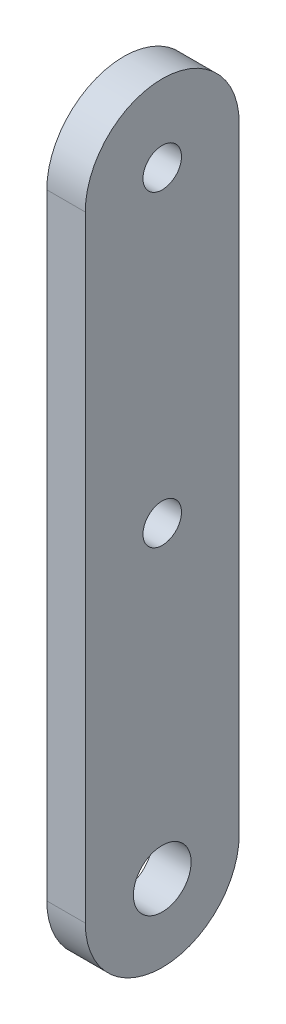
ISO-10303-21;
HEADER;
FILE_DESCRIPTION(('STEP AP214'),'2;1');
FILE_NAME('part.step','',(''),(''),'','','');
FILE_SCHEMA(('AUTOMOTIVE_DESIGN { 1 0 10303 214 1 1 1 1 }'));
ENDSEC;
DATA;
#1=APPLICATION_CONTEXT('core data for automotive mechanical design processes');
#2=APPLICATION_PROTOCOL_DEFINITION('international standard','automotive_design',2000,#1);
#3=PRODUCT_CONTEXT('',#1,'mechanical');
#4=PRODUCT('Part','Part','',(#3));
#5=PRODUCT_RELATED_PRODUCT_CATEGORY('part','',(#4));
#6=PRODUCT_DEFINITION_FORMATION('','',#4);
#7=PRODUCT_DEFINITION_CONTEXT('part definition',#1,'design');
#8=PRODUCT_DEFINITION('design','',#6,#7);
#9=PRODUCT_DEFINITION_SHAPE('','',#8);
#10=(LENGTH_UNIT() NAMED_UNIT(*) SI_UNIT(.MILLI.,.METRE.));
#11=(NAMED_UNIT(*) PLANE_ANGLE_UNIT() SI_UNIT($,.RADIAN.));
#12=(NAMED_UNIT(*) SI_UNIT($,.STERADIAN.) SOLID_ANGLE_UNIT());
#13=UNCERTAINTY_MEASURE_WITH_UNIT(LENGTH_MEASURE(1.E-05),#10,'distance_accuracy_value','');
#14=(GEOMETRIC_REPRESENTATION_CONTEXT(3) GLOBAL_UNCERTAINTY_ASSIGNED_CONTEXT((#13)) GLOBAL_UNIT_ASSIGNED_CONTEXT((#10,
#11,#12)) REPRESENTATION_CONTEXT('',''));
#15=CARTESIAN_POINT('',(0.,0.,0.));
#16=DIRECTION('',(0.,0.,1.));
#17=DIRECTION('',(1.,0.,0.));
#18=AXIS2_PLACEMENT_3D('',#15,#16,#17);
#19=CARTESIAN_POINT('',(6.35,50.8,0.));
#20=DIRECTION('',(1.,0.,0.));
#21=DIRECTION('',(0.,0.,-1.));
#22=AXIS2_PLACEMENT_3D('',#19,#20,#21);
#23=PLANE('',#22);
#24=CARTESIAN_POINT('',(6.35,0.,0.));
#25=DIRECTION('',(1.,0.,0.));
#26=DIRECTION('',(0.,0.,-1.));
#27=AXIS2_PLACEMENT_3D('',#24,#25,#26);
#28=CIRCLE('',#27,3.175);
#29=CARTESIAN_POINT('',(6.35,0.,-3.175));
#30=VERTEX_POINT('',#29);
#31=EDGE_CURVE('E134',#30,#30,#28,.T.);
#32=ORIENTED_EDGE('',*,*,#31,.F.);
#33=EDGE_LOOP('',(#32));
#34=FACE_BOUND('',#33,.T.);
#35=CARTESIAN_POINT('',(6.35,50.8,0.));
#36=DIRECTION('',(1.,0.,0.));
#37=DIRECTION('',(0.,0.,-1.));
#38=AXIS2_PLACEMENT_3D('',#35,#36,#37);
#39=CIRCLE('',#38,12.7);
#40=CARTESIAN_POINT('',(6.35,50.8,-12.7));
#41=VERTEX_POINT('',#40);
#42=CARTESIAN_POINT('',(6.35,50.8,12.7));
#43=VERTEX_POINT('',#42);
#44=EDGE_CURVE('E92',#41,#43,#39,.T.);
#45=ORIENTED_EDGE('',*,*,#44,.T.);
#46=DIRECTION('',(0.,-1.,0.));
#47=VECTOR('',#46,1.);
#48=CARTESIAN_POINT('',(6.35,50.8,12.7));
#49=LINE('',#48,#47);
#50=CARTESIAN_POINT('',(6.35,-50.8,12.7));
#51=VERTEX_POINT('',#50);
#52=EDGE_CURVE('E87',#43,#51,#49,.T.);
#53=ORIENTED_EDGE('',*,*,#52,.T.);
#54=CARTESIAN_POINT('',(6.35,-50.8,0.));
#55=DIRECTION('',(1.,0.,0.));
#56=DIRECTION('',(0.,0.,-1.));
#57=AXIS2_PLACEMENT_3D('',#54,#55,#56);
#58=CIRCLE('',#57,12.7);
#59=CARTESIAN_POINT('',(6.35,-50.8,-12.7));
#60=VERTEX_POINT('',#59);
#61=EDGE_CURVE('E90',#51,#60,#58,.T.);
#62=ORIENTED_EDGE('',*,*,#61,.T.);
#63=DIRECTION('',(0.,1.,0.));
#64=VECTOR('',#63,1.);
#65=CARTESIAN_POINT('',(6.35,50.8,-12.7));
#66=LINE('',#65,#64);
#67=EDGE_CURVE('E57',#60,#41,#66,.T.);
#68=ORIENTED_EDGE('',*,*,#67,.T.);
#69=EDGE_LOOP('',(#45,#53,#62,#68));
#70=FACE_BOUND('',#69,.T.);
#71=CARTESIAN_POINT('',(6.35,50.8,0.));
#72=DIRECTION('',(1.,0.,0.));
#73=DIRECTION('',(0.,0.,-1.));
#74=AXIS2_PLACEMENT_3D('',#71,#72,#73);
#75=CIRCLE('',#74,3.175);
#76=CARTESIAN_POINT('',(6.35,50.8,-3.175));
#77=VERTEX_POINT('',#76);
#78=EDGE_CURVE('E112',#77,#77,#75,.T.);
#79=ORIENTED_EDGE('',*,*,#78,.F.);
#80=EDGE_LOOP('',(#79));
#81=FACE_BOUND('',#80,.T.);
#82=CARTESIAN_POINT('',(6.35,-50.8,0.));
#83=DIRECTION('',(1.,0.,0.));
#84=DIRECTION('',(0.,0.,-1.));
#85=AXIS2_PLACEMENT_3D('',#82,#83,#84);
#86=CIRCLE('',#85,4.7625);
#87=CARTESIAN_POINT('',(6.35,-50.8,-4.76250000000001));
#88=VERTEX_POINT('',#87);
#89=EDGE_CURVE('E142',#88,#88,#86,.T.);
#90=ORIENTED_EDGE('',*,*,#89,.F.);
#91=EDGE_LOOP('',(#90));
#92=FACE_BOUND('',#91,.T.);
#93=ADVANCED_FACE('F39',(#34,#70,#81,#92),#23,.T.);
#94=CARTESIAN_POINT('',(0.,50.8,0.));
#95=DIRECTION('',(1.,0.,0.));
#96=DIRECTION('',(0.,0.,-1.));
#97=AXIS2_PLACEMENT_3D('',#94,#95,#96);
#98=PLANE('',#97);
#99=CARTESIAN_POINT('',(0.,50.8,0.));
#100=DIRECTION('',(1.,0.,0.));
#101=DIRECTION('',(0.,0.,-1.));
#102=AXIS2_PLACEMENT_3D('',#99,#100,#101);
#103=CIRCLE('',#102,12.7);
#104=CARTESIAN_POINT('',(0.,50.8,-12.7));
#105=VERTEX_POINT('',#104);
#106=CARTESIAN_POINT('',(0.,50.8,12.7));
#107=VERTEX_POINT('',#106);
#108=EDGE_CURVE('E108',#105,#107,#103,.T.);
#109=ORIENTED_EDGE('',*,*,#108,.F.);
#110=DIRECTION('',(0.,1.,0.));
#111=VECTOR('',#110,1.);
#112=CARTESIAN_POINT('',(0.,50.8,-12.7));
#113=LINE('',#112,#111);
#114=CARTESIAN_POINT('',(0.,-50.8,-12.7));
#115=VERTEX_POINT('',#114);
#116=EDGE_CURVE('E80',#115,#105,#113,.T.);
#117=ORIENTED_EDGE('',*,*,#116,.F.);
#118=CARTESIAN_POINT('',(0.,-50.8,0.));
#119=DIRECTION('',(1.,0.,0.));
#120=DIRECTION('',(0.,0.,-1.));
#121=AXIS2_PLACEMENT_3D('',#118,#119,#120);
#122=CIRCLE('',#121,12.7);
#123=CARTESIAN_POINT('',(0.,-50.8,12.7));
#124=VERTEX_POINT('',#123);
#125=EDGE_CURVE('E74',#124,#115,#122,.T.);
#126=ORIENTED_EDGE('',*,*,#125,.F.);
#127=DIRECTION('',(0.,-1.,0.));
#128=VECTOR('',#127,1.);
#129=CARTESIAN_POINT('',(0.,50.8,12.7));
#130=LINE('',#129,#128);
#131=EDGE_CURVE('E97',#107,#124,#130,.T.);
#132=ORIENTED_EDGE('',*,*,#131,.F.);
#133=EDGE_LOOP('',(#109,#117,#126,#132));
#134=FACE_BOUND('',#133,.T.);
#135=CARTESIAN_POINT('',(0.,50.8,0.));
#136=DIRECTION('',(1.,0.,0.));
#137=DIRECTION('',(0.,0.,-1.));
#138=AXIS2_PLACEMENT_3D('',#135,#136,#137);
#139=CIRCLE('',#138,3.175);
#140=CARTESIAN_POINT('',(0.,50.8,-3.175));
#141=VERTEX_POINT('',#140);
#142=EDGE_CURVE('E130',#141,#141,#139,.T.);
#143=ORIENTED_EDGE('',*,*,#142,.T.);
#144=EDGE_LOOP('',(#143));
#145=FACE_BOUND('',#144,.T.);
#146=CARTESIAN_POINT('',(0.,0.,0.));
#147=DIRECTION('',(1.,0.,0.));
#148=DIRECTION('',(0.,0.,-1.));
#149=AXIS2_PLACEMENT_3D('',#146,#147,#148);
#150=CIRCLE('',#149,3.175);
#151=CARTESIAN_POINT('',(0.,0.,-3.175));
#152=VERTEX_POINT('',#151);
#153=EDGE_CURVE('E138',#152,#152,#150,.T.);
#154=ORIENTED_EDGE('',*,*,#153,.T.);
#155=EDGE_LOOP('',(#154));
#156=FACE_BOUND('',#155,.T.);
#157=CARTESIAN_POINT('',(0.,-50.8,0.));
#158=DIRECTION('',(1.,0.,0.));
#159=DIRECTION('',(0.,0.,-1.));
#160=AXIS2_PLACEMENT_3D('',#157,#158,#159);
#161=CIRCLE('',#160,4.7625);
#162=CARTESIAN_POINT('',(0.,-50.8,-4.76250000000001));
#163=VERTEX_POINT('',#162);
#164=EDGE_CURVE('E146',#163,#163,#161,.T.);
#165=ORIENTED_EDGE('',*,*,#164,.T.);
#166=EDGE_LOOP('',(#165));
#167=FACE_BOUND('',#166,.T.);
#168=ADVANCED_FACE('F125',(#134,#145,#156,#167),#98,.F.);
#169=CARTESIAN_POINT('',(6.35,50.8,0.));
#170=DIRECTION('',(-1.,0.,0.));
#171=DIRECTION('',(0.,0.,1.));
#172=AXIS2_PLACEMENT_3D('',#169,#170,#171);
#173=CYLINDRICAL_SURFACE('',#172,12.7);
#174=ORIENTED_EDGE('',*,*,#108,.T.);
#175=DIRECTION('',(-1.,0.,0.));
#176=VECTOR('',#175,1.);
#177=CARTESIAN_POINT('',(6.35,50.8,12.7));
#178=LINE('',#177,#176);
#179=EDGE_CURVE('E11',#43,#107,#178,.T.);
#180=ORIENTED_EDGE('',*,*,#179,.F.);
#181=ORIENTED_EDGE('',*,*,#44,.F.);
#182=DIRECTION('',(-1.,0.,0.));
#183=VECTOR('',#182,1.);
#184=CARTESIAN_POINT('',(6.35,50.8,-12.7));
#185=LINE('',#184,#183);
#186=EDGE_CURVE('E104',#41,#105,#185,.T.);
#187=ORIENTED_EDGE('',*,*,#186,.T.);
#188=EDGE_LOOP('',(#174,#180,#181,#187));
#189=FACE_BOUND('',#188,.T.);
#190=ADVANCED_FACE('F41',(#189),#173,.T.);
#191=CARTESIAN_POINT('',(6.35,50.8,12.7));
#192=DIRECTION('',(0.,0.,-1.));
#193=DIRECTION('',(0.,1.,0.));
#194=AXIS2_PLACEMENT_3D('',#191,#192,#193);
#195=PLANE('',#194);
#196=ORIENTED_EDGE('',*,*,#131,.T.);
#197=DIRECTION('',(-1.,0.,0.));
#198=VECTOR('',#197,1.);
#199=CARTESIAN_POINT('',(6.35,-50.8,12.7));
#200=LINE('',#199,#198);
#201=EDGE_CURVE('E49',#51,#124,#200,.T.);
#202=ORIENTED_EDGE('',*,*,#201,.F.);
#203=ORIENTED_EDGE('',*,*,#52,.F.);
#204=ORIENTED_EDGE('',*,*,#179,.T.);
#205=EDGE_LOOP('',(#196,#202,#203,#204));
#206=FACE_BOUND('',#205,.T.);
#207=ADVANCED_FACE('F96',(#206),#195,.F.);
#208=CARTESIAN_POINT('',(6.35,-50.8,0.));
#209=DIRECTION('',(-1.,0.,0.));
#210=DIRECTION('',(0.,0.,1.));
#211=AXIS2_PLACEMENT_3D('',#208,#209,#210);
#212=CYLINDRICAL_SURFACE('',#211,12.7);
#213=ORIENTED_EDGE('',*,*,#125,.T.);
#214=DIRECTION('',(-1.,0.,0.));
#215=VECTOR('',#214,1.);
#216=CARTESIAN_POINT('',(6.35,-50.8,-12.7));
#217=LINE('',#216,#215);
#218=EDGE_CURVE('E99',#60,#115,#217,.T.);
#219=ORIENTED_EDGE('',*,*,#218,.F.);
#220=ORIENTED_EDGE('',*,*,#61,.F.);
#221=ORIENTED_EDGE('',*,*,#201,.T.);
#222=EDGE_LOOP('',(#213,#219,#220,#221));
#223=FACE_BOUND('',#222,.T.);
#224=ADVANCED_FACE('F100',(#223),#212,.T.);
#225=CARTESIAN_POINT('',(6.35,50.8,-12.7));
#226=DIRECTION('',(0.,0.,1.));
#227=DIRECTION('',(0.,-1.,0.));
#228=AXIS2_PLACEMENT_3D('',#225,#226,#227);
#229=PLANE('',#228);
#230=ORIENTED_EDGE('',*,*,#116,.T.);
#231=ORIENTED_EDGE('',*,*,#186,.F.);
#232=ORIENTED_EDGE('',*,*,#67,.F.);
#233=ORIENTED_EDGE('',*,*,#218,.T.);
#234=EDGE_LOOP('',(#230,#231,#232,#233));
#235=FACE_BOUND('',#234,.T.);
#236=ADVANCED_FACE('F122',(#235),#229,.F.);
#237=CARTESIAN_POINT('',(6.35,50.8,0.));
#238=DIRECTION('',(-1.,0.,0.));
#239=DIRECTION('',(0.,0.,1.));
#240=AXIS2_PLACEMENT_3D('',#237,#238,#239);
#241=CYLINDRICAL_SURFACE('',#240,3.175);
#242=ORIENTED_EDGE('',*,*,#78,.T.);
#243=EDGE_LOOP('',(#242));
#244=FACE_BOUND('',#243,.T.);
#245=ORIENTED_EDGE('',*,*,#142,.F.);
#246=EDGE_LOOP('',(#245));
#247=FACE_BOUND('',#246,.T.);
#248=ADVANCED_FACE('F166',(#244,#247),#241,.F.);
#249=CARTESIAN_POINT('',(6.35,0.,0.));
#250=DIRECTION('',(-1.,0.,0.));
#251=DIRECTION('',(0.,0.,1.));
#252=AXIS2_PLACEMENT_3D('',#249,#250,#251);
#253=CYLINDRICAL_SURFACE('',#252,3.175);
#254=ORIENTED_EDGE('',*,*,#31,.T.);
#255=EDGE_LOOP('',(#254));
#256=FACE_BOUND('',#255,.T.);
#257=ORIENTED_EDGE('',*,*,#153,.F.);
#258=EDGE_LOOP('',(#257));
#259=FACE_BOUND('',#258,.T.);
#260=ADVANCED_FACE('F212',(#256,#259),#253,.F.);
#261=CARTESIAN_POINT('',(6.35,-50.8,0.));
#262=DIRECTION('',(-1.,0.,0.));
#263=DIRECTION('',(0.,0.,1.));
#264=AXIS2_PLACEMENT_3D('',#261,#262,#263);
#265=CYLINDRICAL_SURFACE('',#264,4.7625);
#266=ORIENTED_EDGE('',*,*,#89,.T.);
#267=EDGE_LOOP('',(#266));
#268=FACE_BOUND('',#267,.T.);
#269=ORIENTED_EDGE('',*,*,#164,.F.);
#270=EDGE_LOOP('',(#269));
#271=FACE_BOUND('',#270,.T.);
#272=ADVANCED_FACE('F154',(#268,#271),#265,.F.);
#273=CLOSED_SHELL('',(#93,#168,#190,#207,#224,#236,#248,#260,#272));
#274=MANIFOLD_SOLID_BREP('B2',#273);
#275=ADVANCED_BREP_SHAPE_REPRESENTATION('',(#18,#274),#14);
#276=SHAPE_DEFINITION_REPRESENTATION(#9,#275);
ENDSEC;
END-ISO-10303-21;
